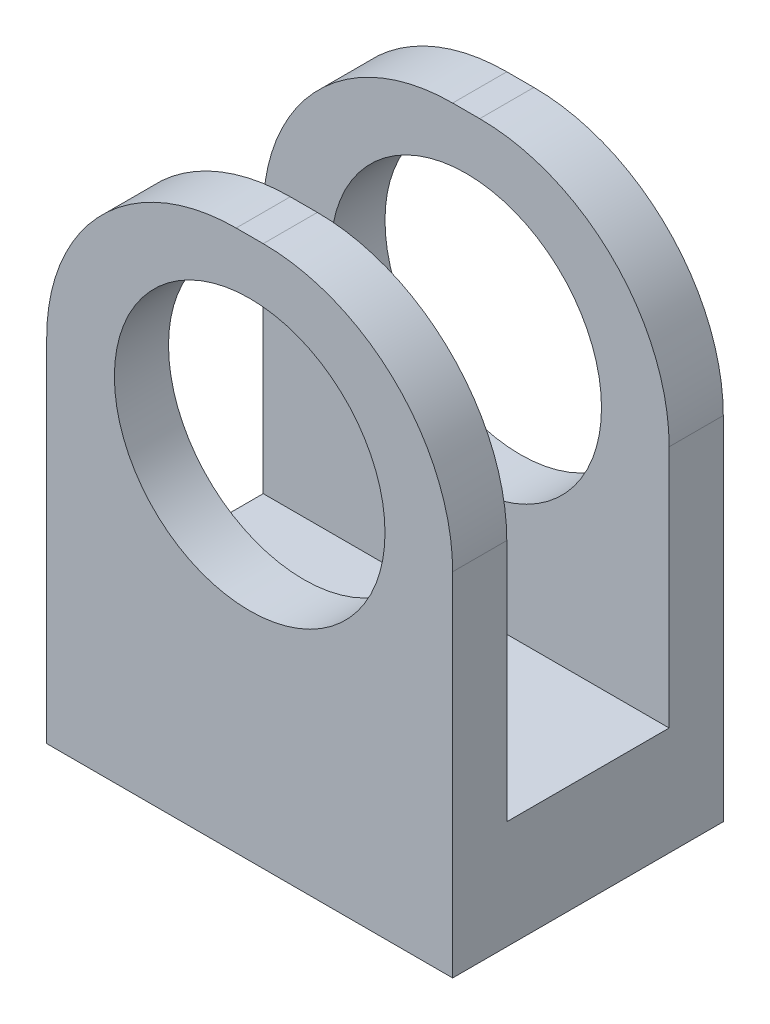
ISO-10303-21;
HEADER;
FILE_DESCRIPTION(('STEP AP214'),'2;1');
FILE_NAME('part.step','',(''),(''),'','','');
FILE_SCHEMA(('AUTOMOTIVE_DESIGN { 1 0 10303 214 1 1 1 1 }'));
ENDSEC;
DATA;
#1=APPLICATION_CONTEXT('core data for automotive mechanical design processes');
#2=APPLICATION_PROTOCOL_DEFINITION('international standard','automotive_design',2000,#1);
#3=PRODUCT_CONTEXT('',#1,'mechanical');
#4=PRODUCT('Part','Part','',(#3));
#5=PRODUCT_RELATED_PRODUCT_CATEGORY('part','',(#4));
#6=PRODUCT_DEFINITION_FORMATION('','',#4);
#7=PRODUCT_DEFINITION_CONTEXT('part definition',#1,'design');
#8=PRODUCT_DEFINITION('design','',#6,#7);
#9=PRODUCT_DEFINITION_SHAPE('','',#8);
#10=(LENGTH_UNIT() NAMED_UNIT(*) SI_UNIT(.MILLI.,.METRE.));
#11=(NAMED_UNIT(*) PLANE_ANGLE_UNIT() SI_UNIT($,.RADIAN.));
#12=(NAMED_UNIT(*) SI_UNIT($,.STERADIAN.) SOLID_ANGLE_UNIT());
#13=UNCERTAINTY_MEASURE_WITH_UNIT(LENGTH_MEASURE(1.E-05),#10,'distance_accuracy_value','');
#14=(GEOMETRIC_REPRESENTATION_CONTEXT(3) GLOBAL_UNCERTAINTY_ASSIGNED_CONTEXT((#13)) GLOBAL_UNIT_ASSIGNED_CONTEXT((#10,
#11,#12)) REPRESENTATION_CONTEXT('',''));
#15=CARTESIAN_POINT('',(0.,0.,0.));
#16=DIRECTION('',(0.,0.,1.));
#17=DIRECTION('',(1.,0.,0.));
#18=AXIS2_PLACEMENT_3D('',#15,#16,#17);
#19=CARTESIAN_POINT('',(-2.852526448973,3.48553719008265,10.));
#20=DIRECTION('',(0.,0.,-1.));
#21=DIRECTION('',(-1.,0.,0.));
#22=AXIS2_PLACEMENT_3D('',#19,#20,#21);
#23=CYLINDRICAL_SURFACE('',#22,7.);
#24=DIRECTION('',(0.,0.,-1.));
#25=VECTOR('',#24,1.);
#26=CARTESIAN_POINT('',(4.147473551027,3.48553719008265,10.));
#27=LINE('',#26,#25);
#28=CARTESIAN_POINT('',(4.147473551027,3.48553719008265,10.));
#29=VERTEX_POINT('',#28);
#30=CARTESIAN_POINT('',(4.14747355102701,3.48553719008265,8.));
#31=VERTEX_POINT('',#30);
#32=EDGE_CURVE('E11',#29,#31,#27,.T.);
#33=ORIENTED_EDGE('',*,*,#32,.T.);
#34=CARTESIAN_POINT('',(-2.852526448973,3.48553719008265,8.));
#35=DIRECTION('',(0.,0.,1.));
#36=DIRECTION('',(0.,-1.,0.));
#37=AXIS2_PLACEMENT_3D('',#34,#35,#36);
#38=CIRCLE('',#37,7.);
#39=CARTESIAN_POINT('',(-2.852526448973,10.4855371900826,8.));
#40=VERTEX_POINT('',#39);
#41=EDGE_CURVE('E218',#31,#40,#38,.T.);
#42=ORIENTED_EDGE('',*,*,#41,.T.);
#43=DIRECTION('',(0.,0.,-1.));
#44=VECTOR('',#43,1.);
#45=CARTESIAN_POINT('',(-2.852526448973,10.4855371900826,10.));
#46=LINE('',#45,#44);
#47=CARTESIAN_POINT('',(-2.852526448973,10.4855371900826,10.));
#48=VERTEX_POINT('',#47);
#49=EDGE_CURVE('E176',#48,#40,#46,.T.);
#50=ORIENTED_EDGE('',*,*,#49,.F.);
#51=CARTESIAN_POINT('',(-2.852526448973,3.48553719008265,10.));
#52=DIRECTION('',(0.,0.,1.));
#53=DIRECTION('',(1.,0.,0.));
#54=AXIS2_PLACEMENT_3D('',#51,#52,#53);
#55=CIRCLE('',#54,7.);
#56=EDGE_CURVE('E101',#29,#48,#55,.T.);
#57=ORIENTED_EDGE('',*,*,#56,.F.);
#58=EDGE_LOOP('',(#33,#42,#50,#57));
#59=FACE_BOUND('',#58,.T.);
#60=ADVANCED_FACE('F39',(#59),#23,.T.);
#61=CARTESIAN_POINT('',(-3.852526448973,10.4855371900826,10.));
#62=DIRECTION('',(0.,-1.,0.));
#63=DIRECTION('',(0.,0.,-1.));
#64=AXIS2_PLACEMENT_3D('',#61,#62,#63);
#65=PLANE('',#64);
#66=ORIENTED_EDGE('',*,*,#49,.T.);
#67=DIRECTION('',(1.,0.,0.));
#68=VECTOR('',#67,1.);
#69=CARTESIAN_POINT('',(-10.852526448973,10.4855371900826,8.));
#70=LINE('',#69,#68);
#71=CARTESIAN_POINT('',(-3.852526448973,10.4855371900826,8.));
#72=VERTEX_POINT('',#71);
#73=EDGE_CURVE('E183',#72,#40,#70,.T.);
#74=ORIENTED_EDGE('',*,*,#73,.F.);
#75=DIRECTION('',(0.,0.,-1.));
#76=VECTOR('',#75,1.);
#77=CARTESIAN_POINT('',(-3.852526448973,10.4855371900826,10.));
#78=LINE('',#77,#76);
#79=CARTESIAN_POINT('',(-3.852526448973,10.4855371900826,10.));
#80=VERTEX_POINT('',#79);
#81=EDGE_CURVE('E172',#80,#72,#78,.T.);
#82=ORIENTED_EDGE('',*,*,#81,.F.);
#83=DIRECTION('',(-1.,0.,0.));
#84=VECTOR('',#83,1.);
#85=CARTESIAN_POINT('',(-3.852526448973,10.4855371900826,10.));
#86=LINE('',#85,#84);
#87=EDGE_CURVE('E118',#48,#80,#86,.T.);
#88=ORIENTED_EDGE('',*,*,#87,.F.);
#89=EDGE_LOOP('',(#66,#74,#82,#88));
#90=FACE_BOUND('',#89,.T.);
#91=ADVANCED_FACE('F253',(#90),#65,.F.);
#92=CARTESIAN_POINT('',(-3.852526448973,3.48553719008265,10.));
#93=DIRECTION('',(0.,0.,-1.));
#94=DIRECTION('',(-1.,0.,0.));
#95=AXIS2_PLACEMENT_3D('',#92,#93,#94);
#96=CYLINDRICAL_SURFACE('',#95,7.);
#97=ORIENTED_EDGE('',*,*,#81,.T.);
#98=CARTESIAN_POINT('',(-3.852526448973,3.48553719008265,8.));
#99=DIRECTION('',(0.,0.,1.));
#100=DIRECTION('',(0.,-1.,0.));
#101=AXIS2_PLACEMENT_3D('',#98,#99,#100);
#102=CIRCLE('',#101,7.);
#103=CARTESIAN_POINT('',(-10.852526448973,3.48553719008265,8.));
#104=VERTEX_POINT('',#103);
#105=EDGE_CURVE('E129',#72,#104,#102,.T.);
#106=ORIENTED_EDGE('',*,*,#105,.T.);
#107=DIRECTION('',(0.,0.,-1.));
#108=VECTOR('',#107,1.);
#109=CARTESIAN_POINT('',(-10.852526448973,3.48553719008265,10.));
#110=LINE('',#109,#108);
#111=CARTESIAN_POINT('',(-10.852526448973,3.48553719008265,10.));
#112=VERTEX_POINT('',#111);
#113=EDGE_CURVE('E126',#112,#104,#110,.T.);
#114=ORIENTED_EDGE('',*,*,#113,.F.);
#115=CARTESIAN_POINT('',(-3.852526448973,3.48553719008265,10.));
#116=DIRECTION('',(0.,0.,1.));
#117=DIRECTION('',(-1.,0.,0.));
#118=AXIS2_PLACEMENT_3D('',#115,#116,#117);
#119=CIRCLE('',#118,7.);
#120=EDGE_CURVE('E110',#80,#112,#119,.T.);
#121=ORIENTED_EDGE('',*,*,#120,.F.);
#122=EDGE_LOOP('',(#97,#106,#114,#121));
#123=FACE_BOUND('',#122,.T.);
#124=ADVANCED_FACE('F127',(#123),#96,.T.);
#125=CARTESIAN_POINT('',(-3.352526448973,3.48553719008265,10.));
#126=DIRECTION('',(0.,0.,-1.));
#127=DIRECTION('',(-1.,0.,0.));
#128=AXIS2_PLACEMENT_3D('',#125,#126,#127);
#129=CYLINDRICAL_SURFACE('',#128,5.);
#130=CARTESIAN_POINT('',(-3.352526448973,3.48553719008265,8.));
#131=DIRECTION('',(0.,0.,1.));
#132=DIRECTION('',(0.,-1.,0.));
#133=AXIS2_PLACEMENT_3D('',#130,#131,#132);
#134=CIRCLE('',#133,5.);
#135=CARTESIAN_POINT('',(-3.352526448973,-1.51446280991735,8.));
#136=VERTEX_POINT('',#135);
#137=EDGE_CURVE('E43',#136,#136,#134,.T.);
#138=ORIENTED_EDGE('',*,*,#137,.F.);
#139=EDGE_LOOP('',(#138));
#140=FACE_BOUND('',#139,.T.);
#141=CARTESIAN_POINT('',(-3.352526448973,3.48553719008265,10.));
#142=DIRECTION('',(0.,0.,1.));
#143=DIRECTION('',(1.,0.,0.));
#144=AXIS2_PLACEMENT_3D('',#141,#142,#143);
#145=CIRCLE('',#144,5.);
#146=CARTESIAN_POINT('',(1.64747355102701,3.48553719008265,10.));
#147=VERTEX_POINT('',#146);
#148=EDGE_CURVE('E150',#147,#147,#145,.T.);
#149=ORIENTED_EDGE('',*,*,#148,.T.);
#150=EDGE_LOOP('',(#149));
#151=FACE_BOUND('',#150,.T.);
#152=ADVANCED_FACE('F238',(#140,#151),#129,.F.);
#153=CARTESIAN_POINT('',(-3.852526448973,3.48553719008265,10.));
#154=DIRECTION('',(0.,0.,-1.));
#155=DIRECTION('',(-1.,0.,0.));
#156=AXIS2_PLACEMENT_3D('',#153,#154,#155);
#157=PLANE('',#156);
#158=DIRECTION('',(0.,1.,0.));
#159=VECTOR('',#158,1.);
#160=CARTESIAN_POINT('',(4.147473551027,3.48553719008265,10.));
#161=LINE('',#160,#159);
#162=CARTESIAN_POINT('',(4.14747355102701,-9.51446280991735,10.));
#163=VERTEX_POINT('',#162);
#164=EDGE_CURVE('E167',#163,#29,#161,.T.);
#165=ORIENTED_EDGE('',*,*,#164,.T.);
#166=ORIENTED_EDGE('',*,*,#56,.T.);
#167=ORIENTED_EDGE('',*,*,#87,.T.);
#168=ORIENTED_EDGE('',*,*,#120,.T.);
#169=DIRECTION('',(0.,-1.,0.));
#170=VECTOR('',#169,1.);
#171=CARTESIAN_POINT('',(-10.852526448973,3.48553719008265,10.));
#172=LINE('',#171,#170);
#173=CARTESIAN_POINT('',(-10.852526448973,-9.51446280991735,10.));
#174=VERTEX_POINT('',#173);
#175=EDGE_CURVE('E115',#112,#174,#172,.T.);
#176=ORIENTED_EDGE('',*,*,#175,.T.);
#177=DIRECTION('',(1.,0.,0.));
#178=VECTOR('',#177,1.);
#179=CARTESIAN_POINT('',(-10.852526448973,-9.51446280991735,10.));
#180=LINE('',#179,#178);
#181=EDGE_CURVE('E66',#174,#163,#180,.T.);
#182=ORIENTED_EDGE('',*,*,#181,.T.);
#183=EDGE_LOOP('',(#165,#166,#167,#168,#176,#182));
#184=FACE_BOUND('',#183,.T.);
#185=ORIENTED_EDGE('',*,*,#148,.F.);
#186=EDGE_LOOP('',(#185));
#187=FACE_BOUND('',#186,.T.);
#188=ADVANCED_FACE('F112',(#184,#187),#157,.F.);
#189=CARTESIAN_POINT('',(-3.852526448973,3.48553719008265,0.));
#190=DIRECTION('',(0.,0.,-1.));
#191=DIRECTION('',(-1.,0.,0.));
#192=AXIS2_PLACEMENT_3D('',#189,#190,#191);
#193=PLANE('',#192);
#194=DIRECTION('',(0.,1.,0.));
#195=VECTOR('',#194,1.);
#196=CARTESIAN_POINT('',(4.147473551027,3.48553719008265,0.));
#197=LINE('',#196,#195);
#198=CARTESIAN_POINT('',(4.14747355102701,-9.51446280991735,0.));
#199=VERTEX_POINT('',#198);
#200=CARTESIAN_POINT('',(4.147473551027,3.48553719008265,0.));
#201=VERTEX_POINT('',#200);
#202=EDGE_CURVE('E145',#199,#201,#197,.T.);
#203=ORIENTED_EDGE('',*,*,#202,.F.);
#204=DIRECTION('',(1.,0.,0.));
#205=VECTOR('',#204,1.);
#206=CARTESIAN_POINT('',(-10.852526448973,-9.51446280991735,0.));
#207=LINE('',#206,#205);
#208=CARTESIAN_POINT('',(-10.852526448973,-9.51446280991735,0.));
#209=VERTEX_POINT('',#208);
#210=EDGE_CURVE('E93',#209,#199,#207,.T.);
#211=ORIENTED_EDGE('',*,*,#210,.F.);
#212=DIRECTION('',(0.,-1.,0.));
#213=VECTOR('',#212,1.);
#214=CARTESIAN_POINT('',(-10.852526448973,3.48553719008265,0.));
#215=LINE('',#214,#213);
#216=CARTESIAN_POINT('',(-10.852526448973,3.48553719008265,0.));
#217=VERTEX_POINT('',#216);
#218=EDGE_CURVE('E162',#217,#209,#215,.T.);
#219=ORIENTED_EDGE('',*,*,#218,.F.);
#220=CARTESIAN_POINT('',(-3.852526448973,3.48553719008265,0.));
#221=DIRECTION('',(0.,0.,1.));
#222=DIRECTION('',(-1.,0.,0.));
#223=AXIS2_PLACEMENT_3D('',#220,#221,#222);
#224=CIRCLE('',#223,7.);
#225=CARTESIAN_POINT('',(-3.852526448973,10.4855371900826,0.));
#226=VERTEX_POINT('',#225);
#227=EDGE_CURVE('E158',#226,#217,#224,.T.);
#228=ORIENTED_EDGE('',*,*,#227,.F.);
#229=DIRECTION('',(-1.,0.,0.));
#230=VECTOR('',#229,1.);
#231=CARTESIAN_POINT('',(-3.852526448973,10.4855371900826,0.));
#232=LINE('',#231,#230);
#233=CARTESIAN_POINT('',(-2.852526448973,10.4855371900826,0.));
#234=VERTEX_POINT('',#233);
#235=EDGE_CURVE('E154',#234,#226,#232,.T.);
#236=ORIENTED_EDGE('',*,*,#235,.F.);
#237=CARTESIAN_POINT('',(-2.852526448973,3.48553719008265,0.));
#238=DIRECTION('',(0.,0.,1.));
#239=DIRECTION('',(1.,0.,0.));
#240=AXIS2_PLACEMENT_3D('',#237,#238,#239);
#241=CIRCLE('',#240,7.);
#242=EDGE_CURVE('E149',#201,#234,#241,.T.);
#243=ORIENTED_EDGE('',*,*,#242,.F.);
#244=EDGE_LOOP('',(#203,#211,#219,#228,#236,#243));
#245=FACE_BOUND('',#244,.T.);
#246=CARTESIAN_POINT('',(-3.352526448973,3.48553719008265,0.));
#247=DIRECTION('',(0.,0.,1.));
#248=DIRECTION('',(1.,0.,0.));
#249=AXIS2_PLACEMENT_3D('',#246,#247,#248);
#250=CIRCLE('',#249,5.);
#251=CARTESIAN_POINT('',(1.64747355102701,3.48553719008265,0.));
#252=VERTEX_POINT('',#251);
#253=EDGE_CURVE('E221',#252,#252,#250,.T.);
#254=ORIENTED_EDGE('',*,*,#253,.T.);
#255=EDGE_LOOP('',(#254));
#256=FACE_BOUND('',#255,.T.);
#257=ADVANCED_FACE('F245',(#245,#256),#193,.T.);
#258=CARTESIAN_POINT('',(4.147473551027,3.48553719008265,10.));
#259=DIRECTION('',(-1.,0.,0.));
#260=DIRECTION('',(0.,-1.,0.));
#261=AXIS2_PLACEMENT_3D('',#258,#259,#260);
#262=PLANE('',#261);
#263=DIRECTION('',(0.,0.,-1.));
#264=VECTOR('',#263,1.);
#265=CARTESIAN_POINT('',(4.14747355102701,-5.51446280991735,8.));
#266=LINE('',#265,#264);
#267=CARTESIAN_POINT('',(4.14747355102701,-5.51446280991735,8.));
#268=VERTEX_POINT('',#267);
#269=CARTESIAN_POINT('',(4.14747355102701,-5.51446280991735,2.));
#270=VERTEX_POINT('',#269);
#271=EDGE_CURVE('E387',#268,#270,#266,.T.);
#272=ORIENTED_EDGE('',*,*,#271,.F.);
#273=DIRECTION('',(0.,-1.,0.));
#274=VECTOR('',#273,1.);
#275=CARTESIAN_POINT('',(4.14747355102701,10.4855371900826,8.));
#276=LINE('',#275,#274);
#277=EDGE_CURVE('E395',#31,#268,#276,.T.);
#278=ORIENTED_EDGE('',*,*,#277,.F.);
#279=ORIENTED_EDGE('',*,*,#32,.F.);
#280=ORIENTED_EDGE('',*,*,#164,.F.);
#281=DIRECTION('',(0.,0.,-1.));
#282=VECTOR('',#281,1.);
#283=CARTESIAN_POINT('',(4.14747355102701,-9.51446280991735,10.));
#284=LINE('',#283,#282);
#285=EDGE_CURVE('E141',#163,#199,#284,.T.);
#286=ORIENTED_EDGE('',*,*,#285,.T.);
#287=ORIENTED_EDGE('',*,*,#202,.T.);
#288=CARTESIAN_POINT('',(4.14747355102701,3.48553719008265,2.));
#289=VERTEX_POINT('',#288);
#290=EDGE_CURVE('E49',#289,#201,#27,.T.);
#291=ORIENTED_EDGE('',*,*,#290,.F.);
#292=DIRECTION('',(0.,1.,0.));
#293=VECTOR('',#292,1.);
#294=CARTESIAN_POINT('',(4.14747355102701,10.4855371900826,2.));
#295=LINE('',#294,#293);
#296=EDGE_CURVE('E204',#270,#289,#295,.T.);
#297=ORIENTED_EDGE('',*,*,#296,.F.);
#298=EDGE_LOOP('',(#272,#278,#279,#280,#286,#287,#291,#297));
#299=FACE_BOUND('',#298,.T.);
#300=ADVANCED_FACE('F41',(#299),#262,.F.);
#301=CARTESIAN_POINT('',(-2.852526448973,10.4855371900826,2.));
#302=VERTEX_POINT('',#301);
#303=EDGE_CURVE('E175',#302,#234,#46,.T.);
#304=ORIENTED_EDGE('',*,*,#303,.F.);
#305=CARTESIAN_POINT('',(-2.852526448973,3.48553719008265,2.));
#306=DIRECTION('',(0.,0.,-1.));
#307=DIRECTION('',(0.,1.,0.));
#308=AXIS2_PLACEMENT_3D('',#305,#306,#307);
#309=CIRCLE('',#308,7.);
#310=EDGE_CURVE('E189',#302,#289,#309,.T.);
#311=ORIENTED_EDGE('',*,*,#310,.T.);
#312=ORIENTED_EDGE('',*,*,#290,.T.);
#313=ORIENTED_EDGE('',*,*,#242,.T.);
#314=EDGE_LOOP('',(#304,#311,#312,#313));
#315=FACE_BOUND('',#314,.T.);
#316=ADVANCED_FACE('F254',(#315),#23,.T.);
#317=CARTESIAN_POINT('',(-3.852526448973,10.4855371900826,2.));
#318=VERTEX_POINT('',#317);
#319=EDGE_CURVE('E133',#318,#226,#78,.T.);
#320=ORIENTED_EDGE('',*,*,#319,.F.);
#321=DIRECTION('',(1.,0.,0.));
#322=VECTOR('',#321,1.);
#323=CARTESIAN_POINT('',(-10.852526448973,10.4855371900826,2.));
#324=LINE('',#323,#322);
#325=EDGE_CURVE('E192',#318,#302,#324,.T.);
#326=ORIENTED_EDGE('',*,*,#325,.T.);
#327=ORIENTED_EDGE('',*,*,#303,.T.);
#328=ORIENTED_EDGE('',*,*,#235,.T.);
#329=EDGE_LOOP('',(#320,#326,#327,#328));
#330=FACE_BOUND('',#329,.T.);
#331=ADVANCED_FACE('F260',(#330),#65,.F.);
#332=CARTESIAN_POINT('',(-10.852526448973,3.48553719008265,2.));
#333=VERTEX_POINT('',#332);
#334=EDGE_CURVE('E134',#333,#217,#110,.T.);
#335=ORIENTED_EDGE('',*,*,#334,.F.);
#336=CARTESIAN_POINT('',(-3.852526448973,3.48553719008265,2.));
#337=DIRECTION('',(0.,0.,-1.));
#338=DIRECTION('',(0.,1.,0.));
#339=AXIS2_PLACEMENT_3D('',#336,#337,#338);
#340=CIRCLE('',#339,7.);
#341=EDGE_CURVE('E182',#333,#318,#340,.T.);
#342=ORIENTED_EDGE('',*,*,#341,.T.);
#343=ORIENTED_EDGE('',*,*,#319,.T.);
#344=ORIENTED_EDGE('',*,*,#227,.T.);
#345=EDGE_LOOP('',(#335,#342,#343,#344));
#346=FACE_BOUND('',#345,.T.);
#347=ADVANCED_FACE('F267',(#346),#96,.T.);
#348=CARTESIAN_POINT('',(-10.852526448973,3.48553719008265,10.));
#349=DIRECTION('',(1.,0.,0.));
#350=DIRECTION('',(0.,1.,0.));
#351=AXIS2_PLACEMENT_3D('',#348,#349,#350);
#352=PLANE('',#351);
#353=ORIENTED_EDGE('',*,*,#113,.T.);
#354=DIRECTION('',(0.,-1.,0.));
#355=VECTOR('',#354,1.);
#356=CARTESIAN_POINT('',(-10.852526448973,10.4855371900826,8.));
#357=LINE('',#356,#355);
#358=CARTESIAN_POINT('',(-10.852526448973,-5.51446280991735,8.));
#359=VERTEX_POINT('',#358);
#360=EDGE_CURVE('E398',#104,#359,#357,.T.);
#361=ORIENTED_EDGE('',*,*,#360,.T.);
#362=DIRECTION('',(0.,0.,-1.));
#363=VECTOR('',#362,1.);
#364=CARTESIAN_POINT('',(-10.852526448973,-5.51446280991735,8.));
#365=LINE('',#364,#363);
#366=CARTESIAN_POINT('',(-10.852526448973,-5.51446280991735,2.));
#367=VERTEX_POINT('',#366);
#368=EDGE_CURVE('E400',#359,#367,#365,.T.);
#369=ORIENTED_EDGE('',*,*,#368,.T.);
#370=DIRECTION('',(0.,1.,0.));
#371=VECTOR('',#370,1.);
#372=CARTESIAN_POINT('',(-10.852526448973,10.4855371900826,2.));
#373=LINE('',#372,#371);
#374=EDGE_CURVE('E57',#367,#333,#373,.T.);
#375=ORIENTED_EDGE('',*,*,#374,.T.);
#376=ORIENTED_EDGE('',*,*,#334,.T.);
#377=ORIENTED_EDGE('',*,*,#218,.T.);
#378=DIRECTION('',(0.,0.,-1.));
#379=VECTOR('',#378,1.);
#380=CARTESIAN_POINT('',(-10.852526448973,-9.51446280991735,10.));
#381=LINE('',#380,#379);
#382=EDGE_CURVE('E137',#174,#209,#381,.T.);
#383=ORIENTED_EDGE('',*,*,#382,.F.);
#384=ORIENTED_EDGE('',*,*,#175,.F.);
#385=EDGE_LOOP('',(#353,#361,#369,#375,#376,#377,#383,#384));
#386=FACE_BOUND('',#385,.T.);
#387=ADVANCED_FACE('F136',(#386),#352,.F.);
#388=CARTESIAN_POINT('',(-10.852526448973,-9.51446280991735,10.));
#389=DIRECTION('',(0.,1.,0.));
#390=DIRECTION('',(0.,0.,1.));
#391=AXIS2_PLACEMENT_3D('',#388,#389,#390);
#392=PLANE('',#391);
#393=ORIENTED_EDGE('',*,*,#210,.T.);
#394=ORIENTED_EDGE('',*,*,#285,.F.);
#395=ORIENTED_EDGE('',*,*,#181,.F.);
#396=ORIENTED_EDGE('',*,*,#382,.T.);
#397=EDGE_LOOP('',(#393,#394,#395,#396));
#398=FACE_BOUND('',#397,.T.);
#399=ADVANCED_FACE('F297',(#398),#392,.F.);
#400=CARTESIAN_POINT('',(-3.352526448973,3.48553719008265,2.));
#401=DIRECTION('',(0.,0.,-1.));
#402=DIRECTION('',(0.,1.,0.));
#403=AXIS2_PLACEMENT_3D('',#400,#401,#402);
#404=CIRCLE('',#403,5.);
#405=CARTESIAN_POINT('',(-3.352526448973,8.48553719008265,2.));
#406=VERTEX_POINT('',#405);
#407=EDGE_CURVE('E179',#406,#406,#404,.T.);
#408=ORIENTED_EDGE('',*,*,#407,.F.);
#409=EDGE_LOOP('',(#408));
#410=FACE_BOUND('',#409,.T.);
#411=ORIENTED_EDGE('',*,*,#253,.F.);
#412=EDGE_LOOP('',(#411));
#413=FACE_BOUND('',#412,.T.);
#414=ADVANCED_FACE('F242',(#410,#413),#129,.F.);
#415=CARTESIAN_POINT('',(-10.852526448973,10.4855371900826,8.));
#416=DIRECTION('',(0.,0.,1.));
#417=DIRECTION('',(0.,-1.,0.));
#418=AXIS2_PLACEMENT_3D('',#415,#416,#417);
#419=PLANE('',#418);
#420=ORIENTED_EDGE('',*,*,#137,.T.);
#421=EDGE_LOOP('',(#420));
#422=FACE_BOUND('',#421,.T.);
#423=ORIENTED_EDGE('',*,*,#277,.T.);
#424=DIRECTION('',(1.,0.,0.));
#425=VECTOR('',#424,1.);
#426=CARTESIAN_POINT('',(-10.852526448973,-5.51446280991735,8.));
#427=LINE('',#426,#425);
#428=EDGE_CURVE('E209',#359,#268,#427,.T.);
#429=ORIENTED_EDGE('',*,*,#428,.F.);
#430=ORIENTED_EDGE('',*,*,#360,.F.);
#431=ORIENTED_EDGE('',*,*,#105,.F.);
#432=ORIENTED_EDGE('',*,*,#73,.T.);
#433=ORIENTED_EDGE('',*,*,#41,.F.);
#434=EDGE_LOOP('',(#423,#429,#430,#431,#432,#433));
#435=FACE_BOUND('',#434,.T.);
#436=ADVANCED_FACE('F236',(#422,#435),#419,.F.);
#437=CARTESIAN_POINT('',(-10.852526448973,10.4855371900826,2.));
#438=DIRECTION('',(0.,0.,-1.));
#439=DIRECTION('',(0.,1.,0.));
#440=AXIS2_PLACEMENT_3D('',#437,#438,#439);
#441=PLANE('',#440);
#442=ORIENTED_EDGE('',*,*,#407,.T.);
#443=EDGE_LOOP('',(#442));
#444=FACE_BOUND('',#443,.T.);
#445=ORIENTED_EDGE('',*,*,#325,.F.);
#446=ORIENTED_EDGE('',*,*,#341,.F.);
#447=ORIENTED_EDGE('',*,*,#374,.F.);
#448=DIRECTION('',(1.,0.,0.));
#449=VECTOR('',#448,1.);
#450=CARTESIAN_POINT('',(-10.852526448973,-5.51446280991735,2.));
#451=LINE('',#450,#449);
#452=EDGE_CURVE('E201',#367,#270,#451,.T.);
#453=ORIENTED_EDGE('',*,*,#452,.T.);
#454=ORIENTED_EDGE('',*,*,#296,.T.);
#455=ORIENTED_EDGE('',*,*,#310,.F.);
#456=EDGE_LOOP('',(#445,#446,#447,#453,#454,#455));
#457=FACE_BOUND('',#456,.T.);
#458=ADVANCED_FACE('F362',(#444,#457),#441,.F.);
#459=CARTESIAN_POINT('',(-10.852526448973,-5.51446280991735,8.));
#460=DIRECTION('',(0.,-1.,0.));
#461=DIRECTION('',(0.,0.,-1.));
#462=AXIS2_PLACEMENT_3D('',#459,#460,#461);
#463=PLANE('',#462);
#464=ORIENTED_EDGE('',*,*,#271,.T.);
#465=ORIENTED_EDGE('',*,*,#452,.F.);
#466=ORIENTED_EDGE('',*,*,#368,.F.);
#467=ORIENTED_EDGE('',*,*,#428,.T.);
#468=EDGE_LOOP('',(#464,#465,#466,#467));
#469=FACE_BOUND('',#468,.T.);
#470=ADVANCED_FACE('F372',(#469),#463,.F.);
#471=CLOSED_SHELL('',(#60,#91,#124,#152,#188,#257,#300,#316,#331,#347,#387,#399,#414,#436,#458,#470));
#472=MANIFOLD_SOLID_BREP('B2',#471);
#473=ADVANCED_BREP_SHAPE_REPRESENTATION('',(#18,#472),#14);
#474=SHAPE_DEFINITION_REPRESENTATION(#9,#473);
ENDSEC;
END-ISO-10303-21;
